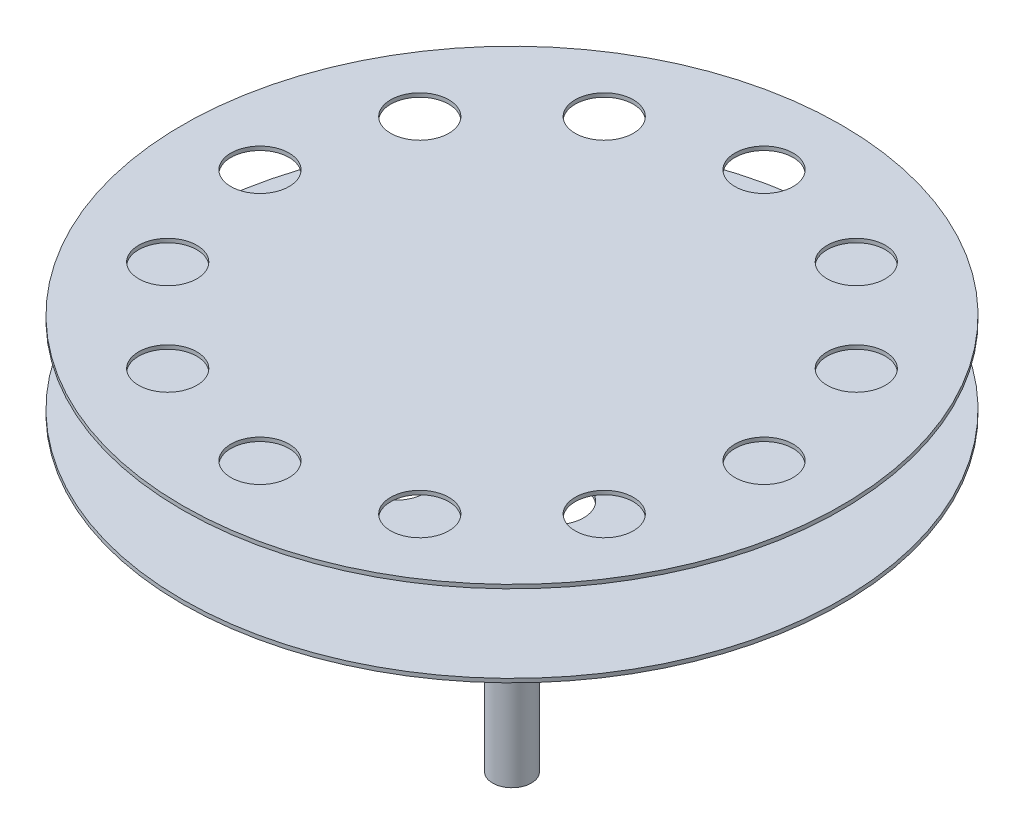
ISO-10303-21;
HEADER;
FILE_DESCRIPTION(('STEP AP214'),'2;1');
FILE_NAME('part.step','',(''),(''),'','','');
FILE_SCHEMA(('AUTOMOTIVE_DESIGN { 1 0 10303 214 1 1 1 1 }'));
ENDSEC;
DATA;
#1=APPLICATION_CONTEXT('core data for automotive mechanical design processes');
#2=APPLICATION_PROTOCOL_DEFINITION('international standard','automotive_design',2000,#1);
#3=PRODUCT_CONTEXT('',#1,'mechanical');
#4=PRODUCT('Part','Part','',(#3));
#5=PRODUCT_RELATED_PRODUCT_CATEGORY('part','',(#4));
#6=PRODUCT_DEFINITION_FORMATION('','',#4);
#7=PRODUCT_DEFINITION_CONTEXT('part definition',#1,'design');
#8=PRODUCT_DEFINITION('design','',#6,#7);
#9=PRODUCT_DEFINITION_SHAPE('','',#8);
#10=(LENGTH_UNIT() NAMED_UNIT(*) SI_UNIT(.MILLI.,.METRE.));
#11=(NAMED_UNIT(*) PLANE_ANGLE_UNIT() SI_UNIT($,.RADIAN.));
#12=(NAMED_UNIT(*) SI_UNIT($,.STERADIAN.) SOLID_ANGLE_UNIT());
#13=UNCERTAINTY_MEASURE_WITH_UNIT(LENGTH_MEASURE(1.E-05),#10,'distance_accuracy_value','');
#14=(GEOMETRIC_REPRESENTATION_CONTEXT(3) GLOBAL_UNCERTAINTY_ASSIGNED_CONTEXT((#13)) GLOBAL_UNIT_ASSIGNED_CONTEXT((#10,
#11,#12)) REPRESENTATION_CONTEXT('',''));
#15=CARTESIAN_POINT('',(0.,0.,0.));
#16=DIRECTION('',(0.,0.,1.));
#17=DIRECTION('',(1.,0.,0.));
#18=AXIS2_PLACEMENT_3D('',#15,#16,#17);
#19=CARTESIAN_POINT('',(0.,102.,0.));
#20=DIRECTION('',(0.,1.,0.));
#21=DIRECTION('',(0.,0.,1.));
#22=AXIS2_PLACEMENT_3D('',#19,#20,#21);
#23=PLANE('',#22);
#24=CARTESIAN_POINT('',(56.2916512459886,102.,-32.4999999999999));
#25=DIRECTION('',(0.,1.,0.));
#26=DIRECTION('',(-0.86602540378444,0.,0.499999999999998));
#27=AXIS2_PLACEMENT_3D('',#24,#25,#26);
#28=CIRCLE('',#27,7.5);
#29=CARTESIAN_POINT('',(49.7964607176053,102.,-28.7499999999999));
#30=VERTEX_POINT('',#29);
#31=EDGE_CURVE('E59',#30,#30,#28,.T.);
#32=ORIENTED_EDGE('',*,*,#31,.F.);
#33=EDGE_LOOP('',(#32));
#34=FACE_BOUND('',#33,.T.);
#35=CARTESIAN_POINT('',(65.,102.,2.26946287024804E-13));
#36=DIRECTION('',(0.,1.,0.));
#37=DIRECTION('',(-1.,0.,0.));
#38=AXIS2_PLACEMENT_3D('',#35,#36,#37);
#39=CIRCLE('',#38,7.5);
#40=CARTESIAN_POINT('',(57.5,102.,2.0076017698348E-13));
#41=VERTEX_POINT('',#40);
#42=EDGE_CURVE('E142',#41,#41,#39,.T.);
#43=ORIENTED_EDGE('',*,*,#42,.F.);
#44=EDGE_LOOP('',(#43));
#45=FACE_BOUND('',#44,.T.);
#46=CARTESIAN_POINT('',(56.2916512459884,102.,32.5000000000003));
#47=DIRECTION('',(0.,1.,0.));
#48=DIRECTION('',(-0.866025403784436,0.,-0.500000000000004));
#49=AXIS2_PLACEMENT_3D('',#46,#47,#48);
#50=CIRCLE('',#49,7.5);
#51=CARTESIAN_POINT('',(49.7964607176051,102.,28.7500000000002));
#52=VERTEX_POINT('',#51);
#53=EDGE_CURVE('E146',#52,#52,#50,.T.);
#54=ORIENTED_EDGE('',*,*,#53,.F.);
#55=EDGE_LOOP('',(#54));
#56=FACE_BOUND('',#55,.T.);
#57=CARTESIAN_POINT('',(32.4999999999997,102.,56.2916512459887));
#58=DIRECTION('',(0.,1.,0.));
#59=DIRECTION('',(-0.499999999999995,0.,-0.866025403784442));
#60=AXIS2_PLACEMENT_3D('',#57,#58,#59);
#61=CIRCLE('',#60,7.5);
#62=CARTESIAN_POINT('',(28.7499999999997,102.,49.7964607176054));
#63=VERTEX_POINT('',#62);
#64=EDGE_CURVE('E150',#63,#63,#61,.T.);
#65=ORIENTED_EDGE('',*,*,#64,.F.);
#66=EDGE_LOOP('',(#65));
#67=FACE_BOUND('',#66,.T.);
#68=CARTESIAN_POINT('',(0.,102.,65.));
#69=DIRECTION('',(0.,1.,0.));
#70=DIRECTION('',(0.,0.,-1.));
#71=AXIS2_PLACEMENT_3D('',#68,#69,#70);
#72=CIRCLE('',#71,7.5);
#73=CARTESIAN_POINT('',(0.,102.,57.5));
#74=VERTEX_POINT('',#73);
#75=EDGE_CURVE('E154',#74,#74,#72,.T.);
#76=ORIENTED_EDGE('',*,*,#75,.F.);
#77=EDGE_LOOP('',(#76));
#78=FACE_BOUND('',#77,.T.);
#79=CARTESIAN_POINT('',(-32.5000000000005,102.,56.2916512459882));
#80=DIRECTION('',(0.,1.,0.));
#81=DIRECTION('',(0.500000000000007,0.,-0.866025403784435));
#82=AXIS2_PLACEMENT_3D('',#79,#80,#81);
#83=CIRCLE('',#82,7.5);
#84=CARTESIAN_POINT('',(-28.7500000000004,102.,49.796460717605));
#85=VERTEX_POINT('',#84);
#86=EDGE_CURVE('E158',#85,#85,#83,.T.);
#87=ORIENTED_EDGE('',*,*,#86,.F.);
#88=EDGE_LOOP('',(#87));
#89=FACE_BOUND('',#88,.T.);
#90=CARTESIAN_POINT('',(-56.2916512459888,102.,32.4999999999995));
#91=DIRECTION('',(0.,1.,0.));
#92=DIRECTION('',(0.866025403784443,0.,-0.499999999999992));
#93=AXIS2_PLACEMENT_3D('',#90,#91,#92);
#94=CIRCLE('',#93,7.5);
#95=CARTESIAN_POINT('',(-49.7964607176055,102.,28.7499999999995));
#96=VERTEX_POINT('',#95);
#97=EDGE_CURVE('E162',#96,#96,#94,.T.);
#98=ORIENTED_EDGE('',*,*,#97,.F.);
#99=EDGE_LOOP('',(#98));
#100=FACE_BOUND('',#99,.T.);
#101=CARTESIAN_POINT('',(-65.,102.,-6.80838861074411E-13));
#102=DIRECTION('',(0.,1.,0.));
#103=DIRECTION('',(1.,0.,0.));
#104=AXIS2_PLACEMENT_3D('',#101,#102,#103);
#105=CIRCLE('',#104,7.5);
#106=CARTESIAN_POINT('',(-57.5,102.,-6.0228053095044E-13));
#107=VERTEX_POINT('',#106);
#108=EDGE_CURVE('E166',#107,#107,#105,.T.);
#109=ORIENTED_EDGE('',*,*,#108,.F.);
#110=EDGE_LOOP('',(#109));
#111=FACE_BOUND('',#110,.T.);
#112=CARTESIAN_POINT('',(-56.2916512459881,102.,-32.5000000000007));
#113=DIRECTION('',(0.,1.,0.));
#114=DIRECTION('',(0.866025403784433,0.,0.50000000000001));
#115=AXIS2_PLACEMENT_3D('',#112,#113,#114);
#116=CIRCLE('',#115,7.5);
#117=CARTESIAN_POINT('',(-49.7964607176049,102.,-28.7500000000006));
#118=VERTEX_POINT('',#117);
#119=EDGE_CURVE('E170',#118,#118,#116,.T.);
#120=ORIENTED_EDGE('',*,*,#119,.F.);
#121=EDGE_LOOP('',(#120));
#122=FACE_BOUND('',#121,.T.);
#123=CARTESIAN_POINT('',(-32.4999999999993,102.,-56.2916512459889));
#124=DIRECTION('',(0.,1.,0.));
#125=DIRECTION('',(0.499999999999989,0.,0.866025403784445));
#126=AXIS2_PLACEMENT_3D('',#123,#124,#125);
#127=CIRCLE('',#126,7.5);
#128=CARTESIAN_POINT('',(-28.7499999999994,102.,-49.7964607176056));
#129=VERTEX_POINT('',#128);
#130=EDGE_CURVE('E92',#129,#129,#127,.T.);
#131=ORIENTED_EDGE('',*,*,#130,.F.);
#132=EDGE_LOOP('',(#131));
#133=FACE_BOUND('',#132,.T.);
#134=CARTESIAN_POINT('',(32.5000000000001,102.,-56.2916512459885));
#135=DIRECTION('',(0.,1.,0.));
#136=DIRECTION('',(-0.500000000000001,0.,0.866025403784438));
#137=AXIS2_PLACEMENT_3D('',#134,#135,#136);
#138=CIRCLE('',#137,7.5);
#139=CARTESIAN_POINT('',(28.7500000000001,102.,-49.7964607176052));
#140=VERTEX_POINT('',#139);
#141=EDGE_CURVE('E54',#140,#140,#138,.T.);
#142=ORIENTED_EDGE('',*,*,#141,.F.);
#143=EDGE_LOOP('',(#142));
#144=FACE_BOUND('',#143,.T.);
#145=CARTESIAN_POINT('',(0.,102.,-65.));
#146=DIRECTION('',(0.,1.,0.));
#147=DIRECTION('',(0.,0.,1.));
#148=AXIS2_PLACEMENT_3D('',#145,#146,#147);
#149=CIRCLE('',#148,7.5);
#150=CARTESIAN_POINT('',(0.,102.,-57.5));
#151=VERTEX_POINT('',#150);
#152=EDGE_CURVE('E50',#151,#151,#149,.T.);
#153=ORIENTED_EDGE('',*,*,#152,.F.);
#154=EDGE_LOOP('',(#153));
#155=FACE_BOUND('',#154,.T.);
#156=CARTESIAN_POINT('',(0.,102.,0.));
#157=DIRECTION('',(0.,1.,0.));
#158=DIRECTION('',(0.,0.,1.));
#159=AXIS2_PLACEMENT_3D('',#156,#157,#158);
#160=CIRCLE('',#159,84.99983);
#161=CARTESIAN_POINT('',(0.,102.,84.99983));
#162=VERTEX_POINT('',#161);
#163=EDGE_CURVE('E10',#162,#162,#160,.T.);
#164=ORIENTED_EDGE('',*,*,#163,.T.);
#165=EDGE_LOOP('',(#164));
#166=FACE_BOUND('',#165,.T.);
#167=ADVANCED_FACE('F30',(#34,#45,#56,#67,#78,#89,#100,#111,#122,#133,#144,#155,#166),#23,.T.);
#168=CARTESIAN_POINT('',(0.,54.8741931878333,0.));
#169=DIRECTION('',(0.,1.,0.));
#170=DIRECTION('',(0.,0.,1.));
#171=AXIS2_PLACEMENT_3D('',#168,#169,#170);
#172=CYLINDRICAL_SURFACE('',#171,84.99983);
#173=CARTESIAN_POINT('',(0.,101.,0.));
#174=DIRECTION('',(0.,1.,0.));
#175=DIRECTION('',(0.,0.,1.));
#176=AXIS2_PLACEMENT_3D('',#173,#174,#175);
#177=CIRCLE('',#176,84.99983);
#178=CARTESIAN_POINT('',(0.,101.,84.99983));
#179=VERTEX_POINT('',#178);
#180=EDGE_CURVE('E37',#179,#179,#177,.T.);
#181=ORIENTED_EDGE('',*,*,#180,.T.);
#182=EDGE_LOOP('',(#181));
#183=FACE_BOUND('',#182,.T.);
#184=ORIENTED_EDGE('',*,*,#163,.F.);
#185=EDGE_LOOP('',(#184));
#186=FACE_BOUND('',#185,.T.);
#187=ADVANCED_FACE('F127',(#183,#186),#172,.T.);
#188=CARTESIAN_POINT('',(-84.99983,101.,0.));
#189=DIRECTION('',(0.,-1.,0.));
#190=DIRECTION('',(0.,0.,-1.));
#191=AXIS2_PLACEMENT_3D('',#188,#189,#190);
#192=PLANE('',#191);
#193=CARTESIAN_POINT('',(56.2916512459886,101.,-32.4999999999999));
#194=DIRECTION('',(0.,-1.,0.));
#195=DIRECTION('',(0.,0.,-1.));
#196=AXIS2_PLACEMENT_3D('',#193,#194,#195);
#197=CIRCLE('',#196,7.5);
#198=CARTESIAN_POINT('',(56.2916512459886,101.,-39.9999999999999));
#199=VERTEX_POINT('',#198);
#200=EDGE_CURVE('E33',#199,#199,#197,.T.);
#201=ORIENTED_EDGE('',*,*,#200,.F.);
#202=EDGE_LOOP('',(#201));
#203=FACE_BOUND('',#202,.T.);
#204=CARTESIAN_POINT('',(65.,101.,2.26946287024804E-13));
#205=DIRECTION('',(0.,-1.,0.));
#206=DIRECTION('',(0.,0.,-1.));
#207=AXIS2_PLACEMENT_3D('',#204,#205,#206);
#208=CIRCLE('',#207,7.5);
#209=CARTESIAN_POINT('',(65.,101.,-7.49999999999978));
#210=VERTEX_POINT('',#209);
#211=EDGE_CURVE('E79',#210,#210,#208,.T.);
#212=ORIENTED_EDGE('',*,*,#211,.F.);
#213=EDGE_LOOP('',(#212));
#214=FACE_BOUND('',#213,.T.);
#215=CARTESIAN_POINT('',(56.2916512459884,101.,32.5000000000003));
#216=DIRECTION('',(0.,-1.,0.));
#217=DIRECTION('',(0.,0.,-1.));
#218=AXIS2_PLACEMENT_3D('',#215,#216,#217);
#219=CIRCLE('',#218,7.5);
#220=CARTESIAN_POINT('',(56.2916512459884,101.,25.0000000000003));
#221=VERTEX_POINT('',#220);
#222=EDGE_CURVE('E77',#221,#221,#219,.T.);
#223=ORIENTED_EDGE('',*,*,#222,.F.);
#224=EDGE_LOOP('',(#223));
#225=FACE_BOUND('',#224,.T.);
#226=CARTESIAN_POINT('',(32.4999999999997,101.,56.2916512459887));
#227=DIRECTION('',(0.,-1.,0.));
#228=DIRECTION('',(0.,0.,-1.));
#229=AXIS2_PLACEMENT_3D('',#226,#227,#228);
#230=CIRCLE('',#229,7.5);
#231=CARTESIAN_POINT('',(32.4999999999997,101.,48.7916512459887));
#232=VERTEX_POINT('',#231);
#233=EDGE_CURVE('E74',#232,#232,#230,.T.);
#234=ORIENTED_EDGE('',*,*,#233,.F.);
#235=EDGE_LOOP('',(#234));
#236=FACE_BOUND('',#235,.T.);
#237=CARTESIAN_POINT('',(0.,101.,65.));
#238=DIRECTION('',(0.,-1.,0.));
#239=DIRECTION('',(0.,0.,-1.));
#240=AXIS2_PLACEMENT_3D('',#237,#238,#239);
#241=CIRCLE('',#240,7.5);
#242=CARTESIAN_POINT('',(0.,101.,57.5));
#243=VERTEX_POINT('',#242);
#244=EDGE_CURVE('E71',#243,#243,#241,.T.);
#245=ORIENTED_EDGE('',*,*,#244,.F.);
#246=EDGE_LOOP('',(#245));
#247=FACE_BOUND('',#246,.T.);
#248=CARTESIAN_POINT('',(-32.5000000000005,101.,56.2916512459882));
#249=DIRECTION('',(0.,-1.,0.));
#250=DIRECTION('',(0.,0.,-1.));
#251=AXIS2_PLACEMENT_3D('',#248,#249,#250);
#252=CIRCLE('',#251,7.5);
#253=CARTESIAN_POINT('',(-32.5000000000005,101.,48.7916512459882));
#254=VERTEX_POINT('',#253);
#255=EDGE_CURVE('E68',#254,#254,#252,.T.);
#256=ORIENTED_EDGE('',*,*,#255,.F.);
#257=EDGE_LOOP('',(#256));
#258=FACE_BOUND('',#257,.T.);
#259=CARTESIAN_POINT('',(-56.2916512459888,101.,32.4999999999995));
#260=DIRECTION('',(0.,-1.,0.));
#261=DIRECTION('',(0.,0.,-1.));
#262=AXIS2_PLACEMENT_3D('',#259,#260,#261);
#263=CIRCLE('',#262,7.5);
#264=CARTESIAN_POINT('',(-56.2916512459888,101.,24.9999999999995));
#265=VERTEX_POINT('',#264);
#266=EDGE_CURVE('E65',#265,#265,#263,.T.);
#267=ORIENTED_EDGE('',*,*,#266,.F.);
#268=EDGE_LOOP('',(#267));
#269=FACE_BOUND('',#268,.T.);
#270=CARTESIAN_POINT('',(-65.,101.,-6.80838861074411E-13));
#271=DIRECTION('',(0.,-1.,0.));
#272=DIRECTION('',(0.,0.,-1.));
#273=AXIS2_PLACEMENT_3D('',#270,#271,#272);
#274=CIRCLE('',#273,7.5);
#275=CARTESIAN_POINT('',(-65.,101.,-7.50000000000068));
#276=VERTEX_POINT('',#275);
#277=EDGE_CURVE('E62',#276,#276,#274,.T.);
#278=ORIENTED_EDGE('',*,*,#277,.F.);
#279=EDGE_LOOP('',(#278));
#280=FACE_BOUND('',#279,.T.);
#281=CARTESIAN_POINT('',(-56.2916512459881,101.,-32.5000000000007));
#282=DIRECTION('',(0.,-1.,0.));
#283=DIRECTION('',(0.,0.,-1.));
#284=AXIS2_PLACEMENT_3D('',#281,#282,#283);
#285=CIRCLE('',#284,7.5);
#286=CARTESIAN_POINT('',(-56.2916512459881,101.,-40.0000000000007));
#287=VERTEX_POINT('',#286);
#288=EDGE_CURVE('E58',#287,#287,#285,.T.);
#289=ORIENTED_EDGE('',*,*,#288,.F.);
#290=EDGE_LOOP('',(#289));
#291=FACE_BOUND('',#290,.T.);
#292=CARTESIAN_POINT('',(-32.4999999999993,101.,-56.2916512459889));
#293=DIRECTION('',(0.,-1.,0.));
#294=DIRECTION('',(0.,0.,-1.));
#295=AXIS2_PLACEMENT_3D('',#292,#293,#294);
#296=CIRCLE('',#295,7.5);
#297=CARTESIAN_POINT('',(-32.4999999999993,101.,-63.7916512459889));
#298=VERTEX_POINT('',#297);
#299=EDGE_CURVE('E55',#298,#298,#296,.T.);
#300=ORIENTED_EDGE('',*,*,#299,.F.);
#301=EDGE_LOOP('',(#300));
#302=FACE_BOUND('',#301,.T.);
#303=CARTESIAN_POINT('',(32.5000000000001,101.,-56.2916512459885));
#304=DIRECTION('',(0.,-1.,0.));
#305=DIRECTION('',(0.,0.,-1.));
#306=AXIS2_PLACEMENT_3D('',#303,#304,#305);
#307=CIRCLE('',#306,7.5);
#308=CARTESIAN_POINT('',(32.5000000000001,101.,-63.7916512459885));
#309=VERTEX_POINT('',#308);
#310=EDGE_CURVE('E51',#309,#309,#307,.T.);
#311=ORIENTED_EDGE('',*,*,#310,.F.);
#312=EDGE_LOOP('',(#311));
#313=FACE_BOUND('',#312,.T.);
#314=CARTESIAN_POINT('',(0.,101.,-65.));
#315=DIRECTION('',(0.,-1.,0.));
#316=DIRECTION('',(0.,0.,-1.));
#317=AXIS2_PLACEMENT_3D('',#314,#315,#316);
#318=CIRCLE('',#317,7.5);
#319=CARTESIAN_POINT('',(0.,101.,-72.5));
#320=VERTEX_POINT('',#319);
#321=EDGE_CURVE('E46',#320,#320,#318,.T.);
#322=ORIENTED_EDGE('',*,*,#321,.F.);
#323=EDGE_LOOP('',(#322));
#324=FACE_BOUND('',#323,.T.);
#325=CARTESIAN_POINT('',(0.,101.,0.));
#326=DIRECTION('',(0.,1.,0.));
#327=DIRECTION('',(0.,0.,1.));
#328=AXIS2_PLACEMENT_3D('',#325,#326,#327);
#329=CIRCLE('',#328,5.);
#330=CARTESIAN_POINT('',(0.,101.,5.));
#331=VERTEX_POINT('',#330);
#332=EDGE_CURVE('E42',#331,#331,#329,.T.);
#333=ORIENTED_EDGE('',*,*,#332,.T.);
#334=EDGE_LOOP('',(#333));
#335=FACE_BOUND('',#334,.T.);
#336=ORIENTED_EDGE('',*,*,#180,.F.);
#337=EDGE_LOOP('',(#336));
#338=FACE_BOUND('',#337,.T.);
#339=ADVANCED_FACE('F112',(#203,#214,#225,#236,#247,#258,#269,#280,#291,#302,#313,#324,#335,
#338),#192,.T.);
#340=CARTESIAN_POINT('',(0.,54.8741931878333,0.));
#341=DIRECTION('',(0.,1.,0.));
#342=DIRECTION('',(0.,0.,1.));
#343=AXIS2_PLACEMENT_3D('',#340,#341,#342);
#344=CYLINDRICAL_SURFACE('',#343,5.00000000000001);
#345=CARTESIAN_POINT('',(0.,81.,0.));
#346=DIRECTION('',(0.,1.,0.));
#347=DIRECTION('',(0.,0.,1.));
#348=AXIS2_PLACEMENT_3D('',#345,#346,#347);
#349=CIRCLE('',#348,5.00000000000001);
#350=CARTESIAN_POINT('',(0.,81.,5.00000000000001));
#351=VERTEX_POINT('',#350);
#352=EDGE_CURVE('E107',#351,#351,#349,.T.);
#353=ORIENTED_EDGE('',*,*,#352,.T.);
#354=EDGE_LOOP('',(#353));
#355=FACE_BOUND('',#354,.T.);
#356=ORIENTED_EDGE('',*,*,#332,.F.);
#357=EDGE_LOOP('',(#356));
#358=FACE_BOUND('',#357,.T.);
#359=ADVANCED_FACE('F115',(#355,#358),#344,.T.);
#360=CARTESIAN_POINT('',(-5.00000000000001,81.,0.));
#361=DIRECTION('',(0.,1.,0.));
#362=DIRECTION('',(0.,0.,1.));
#363=AXIS2_PLACEMENT_3D('',#360,#361,#362);
#364=PLANE('',#363);
#365=CARTESIAN_POINT('',(-25.9807621135331,81.,-15.0000000000001));
#366=DIRECTION('',(0.,1.,0.));
#367=DIRECTION('',(0.,0.,1.));
#368=AXIS2_PLACEMENT_3D('',#365,#366,#367);
#369=CIRCLE('',#368,7.5);
#370=CARTESIAN_POINT('',(-25.9807621135331,81.,-7.50000000000012));
#371=VERTEX_POINT('',#370);
#372=EDGE_CURVE('E430',#371,#371,#369,.T.);
#373=ORIENTED_EDGE('',*,*,#372,.F.);
#374=EDGE_LOOP('',(#373));
#375=FACE_BOUND('',#374,.T.);
#376=CARTESIAN_POINT('',(0.,81.,-30.));
#377=DIRECTION('',(0.,1.,0.));
#378=DIRECTION('',(0.,0.,1.));
#379=AXIS2_PLACEMENT_3D('',#376,#377,#378);
#380=CIRCLE('',#379,7.5);
#381=CARTESIAN_POINT('',(0.,81.,-22.5));
#382=VERTEX_POINT('',#381);
#383=EDGE_CURVE('E451',#382,#382,#380,.T.);
#384=ORIENTED_EDGE('',*,*,#383,.F.);
#385=EDGE_LOOP('',(#384));
#386=FACE_BOUND('',#385,.T.);
#387=CARTESIAN_POINT('',(25.9807621135333,81.,-14.9999999999998));
#388=DIRECTION('',(0.,1.,0.));
#389=DIRECTION('',(0.,0.,1.));
#390=AXIS2_PLACEMENT_3D('',#387,#388,#389);
#391=CIRCLE('',#390,7.5);
#392=CARTESIAN_POINT('',(25.9807621135333,81.,-7.49999999999976));
#393=VERTEX_POINT('',#392);
#394=EDGE_CURVE('E438',#393,#393,#391,.T.);
#395=ORIENTED_EDGE('',*,*,#394,.F.);
#396=EDGE_LOOP('',(#395));
#397=FACE_BOUND('',#396,.T.);
#398=CARTESIAN_POINT('',(25.980762113533,81.,15.0000000000003));
#399=DIRECTION('',(0.,1.,0.));
#400=DIRECTION('',(0.,0.,1.));
#401=AXIS2_PLACEMENT_3D('',#398,#399,#400);
#402=CIRCLE('',#401,7.5);
#403=CARTESIAN_POINT('',(25.980762113533,81.,22.5000000000003));
#404=VERTEX_POINT('',#403);
#405=EDGE_CURVE('E434',#404,#404,#402,.T.);
#406=ORIENTED_EDGE('',*,*,#405,.F.);
#407=EDGE_LOOP('',(#406));
#408=FACE_BOUND('',#407,.T.);
#409=CARTESIAN_POINT('',(-25.9807621135332,81.,14.9999999999999));
#410=DIRECTION('',(0.,1.,0.));
#411=DIRECTION('',(0.,0.,1.));
#412=AXIS2_PLACEMENT_3D('',#409,#410,#411);
#413=CIRCLE('',#412,7.5);
#414=CARTESIAN_POINT('',(-25.9807621135332,81.,22.4999999999999));
#415=VERTEX_POINT('',#414);
#416=EDGE_CURVE('E458',#415,#415,#413,.T.);
#417=ORIENTED_EDGE('',*,*,#416,.F.);
#418=EDGE_LOOP('',(#417));
#419=FACE_BOUND('',#418,.T.);
#420=CARTESIAN_POINT('',(0.,81.,30.));
#421=DIRECTION('',(0.,1.,0.));
#422=DIRECTION('',(0.,0.,1.));
#423=AXIS2_PLACEMENT_3D('',#420,#421,#422);
#424=CIRCLE('',#423,7.5);
#425=CARTESIAN_POINT('',(0.,81.,37.5));
#426=VERTEX_POINT('',#425);
#427=EDGE_CURVE('E464',#426,#426,#424,.T.);
#428=ORIENTED_EDGE('',*,*,#427,.F.);
#429=EDGE_LOOP('',(#428));
#430=FACE_BOUND('',#429,.T.);
#431=CARTESIAN_POINT('',(0.,81.,0.));
#432=DIRECTION('',(0.,1.,0.));
#433=DIRECTION('',(0.,0.,1.));
#434=AXIS2_PLACEMENT_3D('',#431,#432,#433);
#435=CIRCLE('',#434,84.99983);
#436=CARTESIAN_POINT('',(0.,81.,84.99983));
#437=VERTEX_POINT('',#436);
#438=EDGE_CURVE('E104',#437,#437,#435,.T.);
#439=ORIENTED_EDGE('',*,*,#438,.T.);
#440=EDGE_LOOP('',(#439));
#441=FACE_BOUND('',#440,.T.);
#442=ORIENTED_EDGE('',*,*,#352,.F.);
#443=EDGE_LOOP('',(#442));
#444=FACE_BOUND('',#443,.T.);
#445=ADVANCED_FACE('F117',(#375,#386,#397,#408,#419,#430,#441,#444),#364,.T.);
#446=CARTESIAN_POINT('',(0.,54.8741931878333,0.));
#447=DIRECTION('',(0.,1.,0.));
#448=DIRECTION('',(0.,0.,1.));
#449=AXIS2_PLACEMENT_3D('',#446,#447,#448);
#450=CYLINDRICAL_SURFACE('',#449,84.99983);
#451=CARTESIAN_POINT('',(0.,80.,0.));
#452=DIRECTION('',(0.,1.,0.));
#453=DIRECTION('',(0.,0.,1.));
#454=AXIS2_PLACEMENT_3D('',#451,#452,#453);
#455=CIRCLE('',#454,84.99983);
#456=CARTESIAN_POINT('',(0.,80.,84.99983));
#457=VERTEX_POINT('',#456);
#458=EDGE_CURVE('E101',#457,#457,#455,.T.);
#459=ORIENTED_EDGE('',*,*,#458,.T.);
#460=EDGE_LOOP('',(#459));
#461=FACE_BOUND('',#460,.T.);
#462=ORIENTED_EDGE('',*,*,#438,.F.);
#463=EDGE_LOOP('',(#462));
#464=FACE_BOUND('',#463,.T.);
#465=ADVANCED_FACE('F124',(#461,#464),#450,.T.);
#466=CARTESIAN_POINT('',(-84.99983,80.,0.));
#467=DIRECTION('',(0.,-1.,0.));
#468=DIRECTION('',(0.,0.,-1.));
#469=AXIS2_PLACEMENT_3D('',#466,#467,#468);
#470=PLANE('',#469);
#471=CARTESIAN_POINT('',(-25.9807621135331,80.,-15.0000000000001));
#472=DIRECTION('',(0.,-1.,0.));
#473=DIRECTION('',(0.866025403784436,0.,0.500000000000004));
#474=AXIS2_PLACEMENT_3D('',#471,#472,#473);
#475=CIRCLE('',#474,7.5);
#476=CARTESIAN_POINT('',(-19.4855715851498,80.,-11.2500000000001));
#477=VERTEX_POINT('',#476);
#478=EDGE_CURVE('E433',#477,#477,#475,.T.);
#479=ORIENTED_EDGE('',*,*,#478,.F.);
#480=EDGE_LOOP('',(#479));
#481=FACE_BOUND('',#480,.T.);
#482=CARTESIAN_POINT('',(0.,80.,-30.));
#483=DIRECTION('',(0.,-1.,0.));
#484=DIRECTION('',(0.,0.,1.));
#485=AXIS2_PLACEMENT_3D('',#482,#483,#484);
#486=CIRCLE('',#485,7.5);
#487=CARTESIAN_POINT('',(0.,80.,-22.5));
#488=VERTEX_POINT('',#487);
#489=EDGE_CURVE('E435',#488,#488,#486,.T.);
#490=ORIENTED_EDGE('',*,*,#489,.F.);
#491=EDGE_LOOP('',(#490));
#492=FACE_BOUND('',#491,.T.);
#493=CARTESIAN_POINT('',(25.9807621135333,80.,-14.9999999999998));
#494=DIRECTION('',(0.,-1.,0.));
#495=DIRECTION('',(-0.866025403784443,0.,0.499999999999992));
#496=AXIS2_PLACEMENT_3D('',#493,#494,#495);
#497=CIRCLE('',#496,7.5);
#498=CARTESIAN_POINT('',(19.48557158515,80.,-11.2499999999998));
#499=VERTEX_POINT('',#498);
#500=EDGE_CURVE('E441',#499,#499,#497,.T.);
#501=ORIENTED_EDGE('',*,*,#500,.F.);
#502=EDGE_LOOP('',(#501));
#503=FACE_BOUND('',#502,.T.);
#504=CARTESIAN_POINT('',(25.980762113533,80.,15.0000000000003));
#505=DIRECTION('',(0.,-1.,0.));
#506=DIRECTION('',(-0.866025403784433,0.,-0.50000000000001));
#507=AXIS2_PLACEMENT_3D('',#504,#505,#506);
#508=CIRCLE('',#507,7.5);
#509=CARTESIAN_POINT('',(19.4855715851497,80.,11.2500000000002));
#510=VERTEX_POINT('',#509);
#511=EDGE_CURVE('E446',#510,#510,#508,.T.);
#512=ORIENTED_EDGE('',*,*,#511,.F.);
#513=EDGE_LOOP('',(#512));
#514=FACE_BOUND('',#513,.T.);
#515=CARTESIAN_POINT('',(-25.9807621135332,80.,14.9999999999999));
#516=DIRECTION('',(0.,-1.,0.));
#517=DIRECTION('',(0.86602540378444,0.,-0.499999999999998));
#518=AXIS2_PLACEMENT_3D('',#515,#516,#517);
#519=CIRCLE('',#518,7.5);
#520=CARTESIAN_POINT('',(-19.4855715851499,80.,11.25));
#521=VERTEX_POINT('',#520);
#522=EDGE_CURVE('E455',#521,#521,#519,.T.);
#523=ORIENTED_EDGE('',*,*,#522,.F.);
#524=EDGE_LOOP('',(#523));
#525=FACE_BOUND('',#524,.T.);
#526=CARTESIAN_POINT('',(0.,80.,30.));
#527=DIRECTION('',(0.,-1.,0.));
#528=DIRECTION('',(0.,0.,-1.));
#529=AXIS2_PLACEMENT_3D('',#526,#527,#528);
#530=CIRCLE('',#529,7.5);
#531=CARTESIAN_POINT('',(0.,80.,22.5));
#532=VERTEX_POINT('',#531);
#533=EDGE_CURVE('E461',#532,#532,#530,.T.);
#534=ORIENTED_EDGE('',*,*,#533,.F.);
#535=EDGE_LOOP('',(#534));
#536=FACE_BOUND('',#535,.T.);
#537=CARTESIAN_POINT('',(0.,80.,0.));
#538=DIRECTION('',(0.,1.,0.));
#539=DIRECTION('',(0.,0.,1.));
#540=AXIS2_PLACEMENT_3D('',#537,#538,#539);
#541=CIRCLE('',#540,5.00000000000001);
#542=CARTESIAN_POINT('',(0.,80.,5.00000000000001));
#543=VERTEX_POINT('',#542);
#544=EDGE_CURVE('E98',#543,#543,#541,.T.);
#545=ORIENTED_EDGE('',*,*,#544,.T.);
#546=EDGE_LOOP('',(#545));
#547=FACE_BOUND('',#546,.T.);
#548=ORIENTED_EDGE('',*,*,#458,.F.);
#549=EDGE_LOOP('',(#548));
#550=FACE_BOUND('',#549,.T.);
#551=ADVANCED_FACE('F197',(#481,#492,#503,#514,#525,#536,#547,#550),#470,.T.);
#552=CARTESIAN_POINT('',(0.,54.8741931878333,0.));
#553=DIRECTION('',(0.,1.,0.));
#554=DIRECTION('',(0.,0.,1.));
#555=AXIS2_PLACEMENT_3D('',#552,#553,#554);
#556=CYLINDRICAL_SURFACE('',#555,5.00000000000001);
#557=CARTESIAN_POINT('',(0.,0.,0.));
#558=DIRECTION('',(0.,1.,0.));
#559=DIRECTION('',(0.,0.,1.));
#560=AXIS2_PLACEMENT_3D('',#557,#558,#559);
#561=CIRCLE('',#560,5.);
#562=CARTESIAN_POINT('',(0.,0.,5.));
#563=VERTEX_POINT('',#562);
#564=EDGE_CURVE('E49',#563,#563,#561,.T.);
#565=ORIENTED_EDGE('',*,*,#564,.T.);
#566=EDGE_LOOP('',(#565));
#567=FACE_BOUND('',#566,.T.);
#568=ORIENTED_EDGE('',*,*,#544,.F.);
#569=EDGE_LOOP('',(#568));
#570=FACE_BOUND('',#569,.T.);
#571=ADVANCED_FACE('F190',(#567,#570),#556,.T.);
#572=CARTESIAN_POINT('',(-5.,0.,0.));
#573=DIRECTION('',(0.,-1.,0.));
#574=DIRECTION('',(0.,0.,-1.));
#575=AXIS2_PLACEMENT_3D('',#572,#573,#574);
#576=PLANE('',#575);
#577=ORIENTED_EDGE('',*,*,#564,.F.);
#578=EDGE_LOOP('',(#577));
#579=FACE_BOUND('',#578,.T.);
#580=ADVANCED_FACE('F180',(#579),#576,.T.);
#581=CARTESIAN_POINT('',(0.,100.,-65.));
#582=DIRECTION('',(0.,1.,0.));
#583=DIRECTION('',(0.,0.,1.));
#584=AXIS2_PLACEMENT_3D('',#581,#582,#583);
#585=CYLINDRICAL_SURFACE('',#584,7.5);
#586=ORIENTED_EDGE('',*,*,#321,.T.);
#587=EDGE_LOOP('',(#586));
#588=FACE_BOUND('',#587,.T.);
#589=ORIENTED_EDGE('',*,*,#152,.T.);
#590=EDGE_LOOP('',(#589));
#591=FACE_BOUND('',#590,.T.);
#592=ADVANCED_FACE('F177',(#588,#591),#585,.F.);
#593=CARTESIAN_POINT('',(32.5000000000001,100.,-56.2916512459885));
#594=DIRECTION('',(0.,1.,0.));
#595=DIRECTION('',(0.,0.,1.));
#596=AXIS2_PLACEMENT_3D('',#593,#594,#595);
#597=CYLINDRICAL_SURFACE('',#596,7.5);
#598=ORIENTED_EDGE('',*,*,#310,.T.);
#599=EDGE_LOOP('',(#598));
#600=FACE_BOUND('',#599,.T.);
#601=ORIENTED_EDGE('',*,*,#141,.T.);
#602=EDGE_LOOP('',(#601));
#603=FACE_BOUND('',#602,.T.);
#604=ADVANCED_FACE('F179',(#600,#603),#597,.F.);
#605=CARTESIAN_POINT('',(-32.4999999999993,100.,-56.2916512459889));
#606=DIRECTION('',(0.,1.,0.));
#607=DIRECTION('',(0.,0.,1.));
#608=AXIS2_PLACEMENT_3D('',#605,#606,#607);
#609=CYLINDRICAL_SURFACE('',#608,7.5);
#610=ORIENTED_EDGE('',*,*,#299,.T.);
#611=EDGE_LOOP('',(#610));
#612=FACE_BOUND('',#611,.T.);
#613=ORIENTED_EDGE('',*,*,#130,.T.);
#614=EDGE_LOOP('',(#613));
#615=FACE_BOUND('',#614,.T.);
#616=ADVANCED_FACE('F187',(#612,#615),#609,.F.);
#617=CARTESIAN_POINT('',(-56.2916512459881,100.,-32.5000000000007));
#618=DIRECTION('',(0.,1.,0.));
#619=DIRECTION('',(0.,0.,1.));
#620=AXIS2_PLACEMENT_3D('',#617,#618,#619);
#621=CYLINDRICAL_SURFACE('',#620,7.5);
#622=ORIENTED_EDGE('',*,*,#288,.T.);
#623=EDGE_LOOP('',(#622));
#624=FACE_BOUND('',#623,.T.);
#625=ORIENTED_EDGE('',*,*,#119,.T.);
#626=EDGE_LOOP('',(#625));
#627=FACE_BOUND('',#626,.T.);
#628=ADVANCED_FACE('F259',(#624,#627),#621,.F.);
#629=CARTESIAN_POINT('',(-65.,100.,-6.80838861074411E-13));
#630=DIRECTION('',(0.,1.,0.));
#631=DIRECTION('',(0.,0.,1.));
#632=AXIS2_PLACEMENT_3D('',#629,#630,#631);
#633=CYLINDRICAL_SURFACE('',#632,7.5);
#634=ORIENTED_EDGE('',*,*,#277,.T.);
#635=EDGE_LOOP('',(#634));
#636=FACE_BOUND('',#635,.T.);
#637=ORIENTED_EDGE('',*,*,#108,.T.);
#638=EDGE_LOOP('',(#637));
#639=FACE_BOUND('',#638,.T.);
#640=ADVANCED_FACE('F268',(#636,#639),#633,.F.);
#641=CARTESIAN_POINT('',(-56.2916512459888,100.,32.4999999999995));
#642=DIRECTION('',(0.,1.,0.));
#643=DIRECTION('',(0.,0.,1.));
#644=AXIS2_PLACEMENT_3D('',#641,#642,#643);
#645=CYLINDRICAL_SURFACE('',#644,7.5);
#646=ORIENTED_EDGE('',*,*,#266,.T.);
#647=EDGE_LOOP('',(#646));
#648=FACE_BOUND('',#647,.T.);
#649=ORIENTED_EDGE('',*,*,#97,.T.);
#650=EDGE_LOOP('',(#649));
#651=FACE_BOUND('',#650,.T.);
#652=ADVANCED_FACE('F278',(#648,#651),#645,.F.);
#653=CARTESIAN_POINT('',(-32.5000000000005,100.,56.2916512459882));
#654=DIRECTION('',(0.,1.,0.));
#655=DIRECTION('',(0.,0.,1.));
#656=AXIS2_PLACEMENT_3D('',#653,#654,#655);
#657=CYLINDRICAL_SURFACE('',#656,7.5);
#658=ORIENTED_EDGE('',*,*,#255,.T.);
#659=EDGE_LOOP('',(#658));
#660=FACE_BOUND('',#659,.T.);
#661=ORIENTED_EDGE('',*,*,#86,.T.);
#662=EDGE_LOOP('',(#661));
#663=FACE_BOUND('',#662,.T.);
#664=ADVANCED_FACE('F288',(#660,#663),#657,.F.);
#665=CARTESIAN_POINT('',(0.,100.,65.));
#666=DIRECTION('',(0.,1.,0.));
#667=DIRECTION('',(0.,0.,1.));
#668=AXIS2_PLACEMENT_3D('',#665,#666,#667);
#669=CYLINDRICAL_SURFACE('',#668,7.5);
#670=ORIENTED_EDGE('',*,*,#244,.T.);
#671=EDGE_LOOP('',(#670));
#672=FACE_BOUND('',#671,.T.);
#673=ORIENTED_EDGE('',*,*,#75,.T.);
#674=EDGE_LOOP('',(#673));
#675=FACE_BOUND('',#674,.T.);
#676=ADVANCED_FACE('F298',(#672,#675),#669,.F.);
#677=CARTESIAN_POINT('',(32.4999999999997,100.,56.2916512459887));
#678=DIRECTION('',(0.,1.,0.));
#679=DIRECTION('',(0.,0.,1.));
#680=AXIS2_PLACEMENT_3D('',#677,#678,#679);
#681=CYLINDRICAL_SURFACE('',#680,7.5);
#682=ORIENTED_EDGE('',*,*,#233,.T.);
#683=EDGE_LOOP('',(#682));
#684=FACE_BOUND('',#683,.T.);
#685=ORIENTED_EDGE('',*,*,#64,.T.);
#686=EDGE_LOOP('',(#685));
#687=FACE_BOUND('',#686,.T.);
#688=ADVANCED_FACE('F308',(#684,#687),#681,.F.);
#689=CARTESIAN_POINT('',(56.2916512459884,100.,32.5000000000003));
#690=DIRECTION('',(0.,1.,0.));
#691=DIRECTION('',(0.,0.,1.));
#692=AXIS2_PLACEMENT_3D('',#689,#690,#691);
#693=CYLINDRICAL_SURFACE('',#692,7.5);
#694=ORIENTED_EDGE('',*,*,#222,.T.);
#695=EDGE_LOOP('',(#694));
#696=FACE_BOUND('',#695,.T.);
#697=ORIENTED_EDGE('',*,*,#53,.T.);
#698=EDGE_LOOP('',(#697));
#699=FACE_BOUND('',#698,.T.);
#700=ADVANCED_FACE('F318',(#696,#699),#693,.F.);
#701=CARTESIAN_POINT('',(65.,100.,2.26946287024804E-13));
#702=DIRECTION('',(0.,1.,0.));
#703=DIRECTION('',(0.,0.,1.));
#704=AXIS2_PLACEMENT_3D('',#701,#702,#703);
#705=CYLINDRICAL_SURFACE('',#704,7.5);
#706=ORIENTED_EDGE('',*,*,#211,.T.);
#707=EDGE_LOOP('',(#706));
#708=FACE_BOUND('',#707,.T.);
#709=ORIENTED_EDGE('',*,*,#42,.T.);
#710=EDGE_LOOP('',(#709));
#711=FACE_BOUND('',#710,.T.);
#712=ADVANCED_FACE('F328',(#708,#711),#705,.F.);
#713=CARTESIAN_POINT('',(56.2916512459886,100.,-32.4999999999999));
#714=DIRECTION('',(0.,1.,0.));
#715=DIRECTION('',(0.,0.,1.));
#716=AXIS2_PLACEMENT_3D('',#713,#714,#715);
#717=CYLINDRICAL_SURFACE('',#716,7.5);
#718=ORIENTED_EDGE('',*,*,#200,.T.);
#719=EDGE_LOOP('',(#718));
#720=FACE_BOUND('',#719,.T.);
#721=ORIENTED_EDGE('',*,*,#31,.T.);
#722=EDGE_LOOP('',(#721));
#723=FACE_BOUND('',#722,.T.);
#724=ADVANCED_FACE('F338',(#720,#723),#717,.F.);
#725=CARTESIAN_POINT('',(0.,82.,30.));
#726=DIRECTION('',(0.,-1.,0.));
#727=DIRECTION('',(0.,0.,-1.));
#728=AXIS2_PLACEMENT_3D('',#725,#726,#727);
#729=CYLINDRICAL_SURFACE('',#728,7.5);
#730=ORIENTED_EDGE('',*,*,#427,.T.);
#731=EDGE_LOOP('',(#730));
#732=FACE_BOUND('',#731,.T.);
#733=ORIENTED_EDGE('',*,*,#533,.T.);
#734=EDGE_LOOP('',(#733));
#735=FACE_BOUND('',#734,.T.);
#736=ADVANCED_FACE('F347',(#732,#735),#729,.F.);
#737=CARTESIAN_POINT('',(-25.9807621135332,82.,14.9999999999999));
#738=DIRECTION('',(0.,-1.,0.));
#739=DIRECTION('',(0.,0.,-1.));
#740=AXIS2_PLACEMENT_3D('',#737,#738,#739);
#741=CYLINDRICAL_SURFACE('',#740,7.5);
#742=ORIENTED_EDGE('',*,*,#416,.T.);
#743=EDGE_LOOP('',(#742));
#744=FACE_BOUND('',#743,.T.);
#745=ORIENTED_EDGE('',*,*,#522,.T.);
#746=EDGE_LOOP('',(#745));
#747=FACE_BOUND('',#746,.T.);
#748=ADVANCED_FACE('F355',(#744,#747),#741,.F.);
#749=CARTESIAN_POINT('',(25.980762113533,82.,15.0000000000003));
#750=DIRECTION('',(0.,-1.,0.));
#751=DIRECTION('',(0.,0.,-1.));
#752=AXIS2_PLACEMENT_3D('',#749,#750,#751);
#753=CYLINDRICAL_SURFACE('',#752,7.5);
#754=ORIENTED_EDGE('',*,*,#405,.T.);
#755=EDGE_LOOP('',(#754));
#756=FACE_BOUND('',#755,.T.);
#757=ORIENTED_EDGE('',*,*,#511,.T.);
#758=EDGE_LOOP('',(#757));
#759=FACE_BOUND('',#758,.T.);
#760=ADVANCED_FACE('F383',(#756,#759),#753,.F.);
#761=CARTESIAN_POINT('',(25.9807621135333,82.,-14.9999999999998));
#762=DIRECTION('',(0.,-1.,0.));
#763=DIRECTION('',(0.,0.,-1.));
#764=AXIS2_PLACEMENT_3D('',#761,#762,#763);
#765=CYLINDRICAL_SURFACE('',#764,7.5);
#766=ORIENTED_EDGE('',*,*,#394,.T.);
#767=EDGE_LOOP('',(#766));
#768=FACE_BOUND('',#767,.T.);
#769=ORIENTED_EDGE('',*,*,#500,.T.);
#770=EDGE_LOOP('',(#769));
#771=FACE_BOUND('',#770,.T.);
#772=ADVANCED_FACE('F390',(#768,#771),#765,.F.);
#773=CARTESIAN_POINT('',(0.,82.,-30.));
#774=DIRECTION('',(0.,-1.,0.));
#775=DIRECTION('',(0.,0.,-1.));
#776=AXIS2_PLACEMENT_3D('',#773,#774,#775);
#777=CYLINDRICAL_SURFACE('',#776,7.5);
#778=ORIENTED_EDGE('',*,*,#383,.T.);
#779=EDGE_LOOP('',(#778));
#780=FACE_BOUND('',#779,.T.);
#781=ORIENTED_EDGE('',*,*,#489,.T.);
#782=EDGE_LOOP('',(#781));
#783=FACE_BOUND('',#782,.T.);
#784=ADVANCED_FACE('F398',(#780,#783),#777,.F.);
#785=CARTESIAN_POINT('',(-25.9807621135331,82.,-15.0000000000001));
#786=DIRECTION('',(0.,-1.,0.));
#787=DIRECTION('',(0.,0.,-1.));
#788=AXIS2_PLACEMENT_3D('',#785,#786,#787);
#789=CYLINDRICAL_SURFACE('',#788,7.5);
#790=ORIENTED_EDGE('',*,*,#372,.T.);
#791=EDGE_LOOP('',(#790));
#792=FACE_BOUND('',#791,.T.);
#793=ORIENTED_EDGE('',*,*,#478,.T.);
#794=EDGE_LOOP('',(#793));
#795=FACE_BOUND('',#794,.T.);
#796=ADVANCED_FACE('F406',(#792,#795),#789,.F.);
#797=CLOSED_SHELL('',(#167,#187,#339,#359,#445,#465,#551,#571,#580,#592,#604,#616,#628,#640,
#652,#664,#676,#688,#700,#712,#724,#736,#748,#760,#772,#784,#796));
#798=MANIFOLD_SOLID_BREP('B2',#797);
#799=ADVANCED_BREP_SHAPE_REPRESENTATION('',(#18,#798),#14);
#800=SHAPE_DEFINITION_REPRESENTATION(#9,#799);
ENDSEC;
END-ISO-10303-21;
